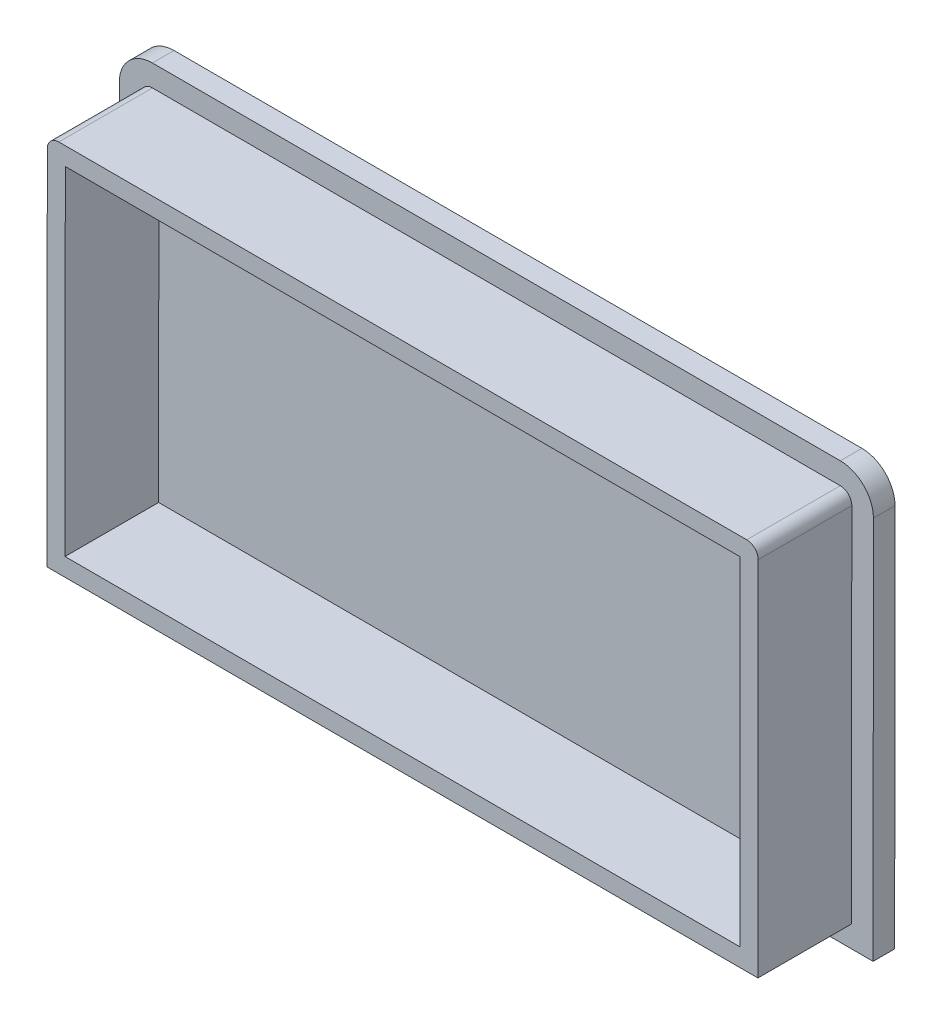
ISO-10303-21;
HEADER;
FILE_DESCRIPTION(('STEP AP214'),'2;1');
FILE_NAME('part.step','',(''),(''),'','','');
FILE_SCHEMA(('AUTOMOTIVE_DESIGN { 1 0 10303 214 1 1 1 1 }'));
ENDSEC;
DATA;
#1=APPLICATION_CONTEXT('core data for automotive mechanical design processes');
#2=APPLICATION_PROTOCOL_DEFINITION('international standard','automotive_design',2000,#1);
#3=PRODUCT_CONTEXT('',#1,'mechanical');
#4=PRODUCT('Part','Part','',(#3));
#5=PRODUCT_RELATED_PRODUCT_CATEGORY('part','',(#4));
#6=PRODUCT_DEFINITION_FORMATION('','',#4);
#7=PRODUCT_DEFINITION_CONTEXT('part definition',#1,'design');
#8=PRODUCT_DEFINITION('design','',#6,#7);
#9=PRODUCT_DEFINITION_SHAPE('','',#8);
#10=(LENGTH_UNIT() NAMED_UNIT(*) SI_UNIT(.MILLI.,.METRE.));
#11=(NAMED_UNIT(*) PLANE_ANGLE_UNIT() SI_UNIT($,.RADIAN.));
#12=(NAMED_UNIT(*) SI_UNIT($,.STERADIAN.) SOLID_ANGLE_UNIT());
#13=UNCERTAINTY_MEASURE_WITH_UNIT(LENGTH_MEASURE(1.E-05),#10,'distance_accuracy_value','');
#14=(GEOMETRIC_REPRESENTATION_CONTEXT(3) GLOBAL_UNCERTAINTY_ASSIGNED_CONTEXT((#13)) GLOBAL_UNIT_ASSIGNED_CONTEXT((#10,
#11,#12)) REPRESENTATION_CONTEXT('',''));
#15=CARTESIAN_POINT('',(0.,0.,0.));
#16=DIRECTION('',(0.,0.,1.));
#17=DIRECTION('',(1.,0.,0.));
#18=AXIS2_PLACEMENT_3D('',#15,#16,#17);
#19=CARTESIAN_POINT('',(-14.0632369728876,53.7477321432282,13.));
#20=DIRECTION('',(0.,0.,1.));
#21=DIRECTION('',(1.,0.,0.));
#22=AXIS2_PLACEMENT_3D('',#19,#20,#21);
#23=PLANE('',#22);
#24=DIRECTION('',(0.000819517229328199,0.999999664195699,0.));
#25=VECTOR('',#24,1.);
#26=CARTESIAN_POINT('',(-12.5044888843404,3.41024879228806,13.));
#27=LINE('',#26,#25);
#28=CARTESIAN_POINT('',(-12.5044888843404,3.41024879228806,13.));
#29=VERTEX_POINT('',#28);
#30=CARTESIAN_POINT('',(-12.4632375101745,53.7464209156613,13.));
#31=VERTEX_POINT('',#30);
#32=EDGE_CURVE('E145',#29,#31,#27,.T.);
#33=ORIENTED_EDGE('',*,*,#32,.T.);
#34=CARTESIAN_POINT('',(-14.0632369728876,53.7477321432282,13.));
#35=DIRECTION('',(0.,0.,1.));
#36=DIRECTION('',(1.,0.,0.));
#37=AXIS2_PLACEMENT_3D('',#34,#35,#36);
#38=CIRCLE('',#37,1.59999999999996);
#39=CARTESIAN_POINT('',(-14.0619257453207,55.3477316059413,13.));
#40=VERTEX_POINT('',#39);
#41=EDGE_CURVE('E156',#31,#40,#38,.T.);
#42=ORIENTED_EDGE('',*,*,#41,.T.);
#43=DIRECTION('',(-0.999999664195699,0.000819517229328083,0.));
#44=VECTOR('',#43,1.);
#45=CARTESIAN_POINT('',(-14.0619257453207,55.3477316059413,13.));
#46=LINE('',#45,#44);
#47=CARTESIAN_POINT('',(-109.606266497076,55.4260318656457,13.));
#48=VERTEX_POINT('',#47);
#49=EDGE_CURVE('E109',#40,#48,#46,.T.);
#50=ORIENTED_EDGE('',*,*,#49,.T.);
#51=CARTESIAN_POINT('',(-109.607577724643,53.8260324029326,13.));
#52=DIRECTION('',(0.,0.,1.));
#53=DIRECTION('',(1.,0.,0.));
#54=AXIS2_PLACEMENT_3D('',#51,#52,#53);
#55=CIRCLE('',#54,1.59999999999998);
#56=CARTESIAN_POINT('',(-111.207577187356,53.8273436304995,13.));
#57=VERTEX_POINT('',#56);
#58=EDGE_CURVE('E102',#48,#57,#55,.T.);
#59=ORIENTED_EDGE('',*,*,#58,.T.);
#60=DIRECTION('',(-0.000819517229326614,-0.999999664195699,0.));
#61=VECTOR('',#60,1.);
#62=CARTESIAN_POINT('',(-111.207577187356,53.8273436304995,13.));
#63=LINE('',#62,#61);
#64=CARTESIAN_POINT('',(-111.248828561522,3.49117150712631,13.));
#65=VERTEX_POINT('',#64);
#66=EDGE_CURVE('E106',#57,#65,#63,.T.);
#67=ORIENTED_EDGE('',*,*,#66,.T.);
#68=DIRECTION('',(0.999999664195699,-0.000819517229327872,0.));
#69=VECTOR('',#68,1.);
#70=CARTESIAN_POINT('',(-111.248828561522,3.49117150712631,13.));
#71=LINE('',#70,#69);
#72=EDGE_CURVE('E58',#65,#29,#71,.T.);
#73=ORIENTED_EDGE('',*,*,#72,.T.);
#74=EDGE_LOOP('',(#33,#42,#50,#59,#67,#73));
#75=FACE_BOUND('',#74,.T.);
#76=DIRECTION('',(0.999999664195699,-0.000819517229327869,0.));
#77=VECTOR('',#76,1.);
#78=CARTESIAN_POINT('',(-108.74678060796,5.98912187454224,13.));
#79=LINE('',#78,#77);
#80=CARTESIAN_POINT('',(-108.74678060796,5.98912187454224,13.));
#81=VERTEX_POINT('',#80);
#82=CARTESIAN_POINT('',(-15.0024392517564,5.91229674585063,13.));
#83=VERTEX_POINT('',#82);
#84=EDGE_CURVE('E185',#81,#83,#79,.T.);
#85=ORIENTED_EDGE('',*,*,#84,.F.);
#86=DIRECTION('',(-0.000819517229326577,-0.999999664195699,0.));
#87=VECTOR('',#86,1.);
#88=CARTESIAN_POINT('',(-108.708315592374,52.9252951396501,13.));
#89=LINE('',#88,#87);
#90=CARTESIAN_POINT('',(-108.708315592374,52.9252951396501,13.));
#91=VERTEX_POINT('',#90);
#92=EDGE_CURVE('E178',#91,#81,#89,.T.);
#93=ORIENTED_EDGE('',*,*,#92,.F.);
#94=DIRECTION('',(-0.999999664195699,0.000819517229328146,0.));
#95=VECTOR('',#94,1.);
#96=CARTESIAN_POINT('',(-14.9639742361702,52.8484700109585,13.));
#97=LINE('',#96,#95);
#98=CARTESIAN_POINT('',(-14.9639742361702,52.8484700109585,13.));
#99=VERTEX_POINT('',#98);
#100=EDGE_CURVE('E80',#99,#91,#97,.T.);
#101=ORIENTED_EDGE('',*,*,#100,.F.);
#102=DIRECTION('',(0.000819517229328204,0.999999664195699,0.));
#103=VECTOR('',#102,1.);
#104=CARTESIAN_POINT('',(-15.0024392517564,5.91229674585063,13.));
#105=LINE('',#104,#103);
#106=EDGE_CURVE('E196',#83,#99,#105,.T.);
#107=ORIENTED_EDGE('',*,*,#106,.F.);
#108=EDGE_LOOP('',(#85,#93,#101,#107));
#109=FACE_BOUND('',#108,.T.);
#110=ADVANCED_FACE('F34',(#75,#109),#23,.T.);
#111=CARTESIAN_POINT('',(-12.5044888843404,3.41024879228806,13.));
#112=DIRECTION('',(-0.999999664195699,0.000819517229328199,0.));
#113=DIRECTION('',(-0.000819517229328199,-0.999999664195699,0.));
#114=AXIS2_PLACEMENT_3D('',#111,#112,#113);
#115=PLANE('',#114);
#116=DIRECTION('',(0.000819517229328199,0.999999664195699,0.));
#117=VECTOR('',#116,1.);
#118=CARTESIAN_POINT('',(-12.5044888843404,3.41024879228806,0.));
#119=LINE('',#118,#117);
#120=CARTESIAN_POINT('',(-12.5044888843404,3.41024879228806,0.));
#121=VERTEX_POINT('',#120);
#122=CARTESIAN_POINT('',(-12.4632375101745,53.7464209156613,0.));
#123=VERTEX_POINT('',#122);
#124=EDGE_CURVE('E132',#121,#123,#119,.T.);
#125=ORIENTED_EDGE('',*,*,#124,.T.);
#126=DIRECTION('',(0.,0.,-1.));
#127=VECTOR('',#126,1.);
#128=CARTESIAN_POINT('',(-12.4632375101745,53.7464209156613,13.));
#129=LINE('',#128,#127);
#130=EDGE_CURVE('E11',#31,#123,#129,.T.);
#131=ORIENTED_EDGE('',*,*,#130,.F.);
#132=ORIENTED_EDGE('',*,*,#32,.F.);
#133=DIRECTION('',(0.,0.,-1.));
#134=VECTOR('',#133,1.);
#135=CARTESIAN_POINT('',(-12.5044888843404,3.41024879228806,13.));
#136=LINE('',#135,#134);
#137=EDGE_CURVE('E128',#29,#121,#136,.T.);
#138=ORIENTED_EDGE('',*,*,#137,.T.);
#139=EDGE_LOOP('',(#125,#131,#132,#138));
#140=FACE_BOUND('',#139,.T.);
#141=ADVANCED_FACE('F36',(#140),#115,.F.);
#142=CARTESIAN_POINT('',(-14.0632369728876,53.7477321432282,13.));
#143=DIRECTION('',(0.,0.,-1.));
#144=DIRECTION('',(-1.,0.,0.));
#145=AXIS2_PLACEMENT_3D('',#142,#143,#144);
#146=CYLINDRICAL_SURFACE('',#145,1.59999999999996);
#147=CARTESIAN_POINT('',(-14.0632369728876,53.7477321432282,0.));
#148=DIRECTION('',(0.,0.,1.));
#149=DIRECTION('',(1.,0.,0.));
#150=AXIS2_PLACEMENT_3D('',#147,#148,#149);
#151=CIRCLE('',#150,1.59999999999996);
#152=CARTESIAN_POINT('',(-14.0619257453207,55.3477316059413,0.));
#153=VERTEX_POINT('',#152);
#154=EDGE_CURVE('E135',#123,#153,#151,.T.);
#155=ORIENTED_EDGE('',*,*,#154,.T.);
#156=DIRECTION('',(0.,0.,-1.));
#157=VECTOR('',#156,1.);
#158=CARTESIAN_POINT('',(-14.0619257453207,55.3477316059413,13.));
#159=LINE('',#158,#157);
#160=EDGE_CURVE('E42',#40,#153,#159,.T.);
#161=ORIENTED_EDGE('',*,*,#160,.F.);
#162=ORIENTED_EDGE('',*,*,#41,.F.);
#163=ORIENTED_EDGE('',*,*,#130,.T.);
#164=EDGE_LOOP('',(#155,#161,#162,#163));
#165=FACE_BOUND('',#164,.T.);
#166=ADVANCED_FACE('F155',(#165),#146,.T.);
#167=CARTESIAN_POINT('',(-14.0619257453207,55.3477316059413,13.));
#168=DIRECTION('',(-0.000819517229328083,-0.999999664195699,0.));
#169=DIRECTION('',(0.999999664195699,-0.000819517229328083,0.));
#170=AXIS2_PLACEMENT_3D('',#167,#168,#169);
#171=PLANE('',#170);
#172=DIRECTION('',(-0.999999664195699,0.000819517229328083,0.));
#173=VECTOR('',#172,1.);
#174=CARTESIAN_POINT('',(-14.0619257453207,55.3477316059413,0.));
#175=LINE('',#174,#173);
#176=CARTESIAN_POINT('',(-109.606266497076,55.4260318656457,0.));
#177=VERTEX_POINT('',#176);
#178=EDGE_CURVE('E71',#153,#177,#175,.T.);
#179=ORIENTED_EDGE('',*,*,#178,.T.);
#180=DIRECTION('',(0.,0.,-1.));
#181=VECTOR('',#180,1.);
#182=CARTESIAN_POINT('',(-109.606266497076,55.4260318656457,13.));
#183=LINE('',#182,#181);
#184=EDGE_CURVE('E122',#48,#177,#183,.T.);
#185=ORIENTED_EDGE('',*,*,#184,.F.);
#186=ORIENTED_EDGE('',*,*,#49,.F.);
#187=ORIENTED_EDGE('',*,*,#160,.T.);
#188=EDGE_LOOP('',(#179,#185,#186,#187));
#189=FACE_BOUND('',#188,.T.);
#190=ADVANCED_FACE('F152',(#189),#171,.F.);
#191=CARTESIAN_POINT('',(-109.607577724643,53.8260324029326,13.));
#192=DIRECTION('',(0.,0.,-1.));
#193=DIRECTION('',(-1.,0.,0.));
#194=AXIS2_PLACEMENT_3D('',#191,#192,#193);
#195=CYLINDRICAL_SURFACE('',#194,1.59999999999998);
#196=CARTESIAN_POINT('',(-109.607577724643,53.8260324029326,0.));
#197=DIRECTION('',(0.,0.,1.));
#198=DIRECTION('',(1.,0.,0.));
#199=AXIS2_PLACEMENT_3D('',#196,#197,#198);
#200=CIRCLE('',#199,1.59999999999998);
#201=CARTESIAN_POINT('',(-111.207577187356,53.8273436304995,0.));
#202=VERTEX_POINT('',#201);
#203=EDGE_CURVE('E119',#177,#202,#200,.T.);
#204=ORIENTED_EDGE('',*,*,#203,.T.);
#205=DIRECTION('',(0.,0.,-1.));
#206=VECTOR('',#205,1.);
#207=CARTESIAN_POINT('',(-111.207577187356,53.8273436304995,13.));
#208=LINE('',#207,#206);
#209=EDGE_CURVE('E116',#57,#202,#208,.T.);
#210=ORIENTED_EDGE('',*,*,#209,.F.);
#211=ORIENTED_EDGE('',*,*,#58,.F.);
#212=ORIENTED_EDGE('',*,*,#184,.T.);
#213=EDGE_LOOP('',(#204,#210,#211,#212));
#214=FACE_BOUND('',#213,.T.);
#215=ADVANCED_FACE('F117',(#214),#195,.T.);
#216=CARTESIAN_POINT('',(-111.207577187356,53.8273436304995,13.));
#217=DIRECTION('',(0.999999664195699,-0.000819517229326614,0.));
#218=DIRECTION('',(0.000819517229326614,0.999999664195699,0.));
#219=AXIS2_PLACEMENT_3D('',#216,#217,#218);
#220=PLANE('',#219);
#221=DIRECTION('',(-0.000819517229326614,-0.999999664195699,0.));
#222=VECTOR('',#221,1.);
#223=CARTESIAN_POINT('',(-111.207577187356,53.8273436304995,0.));
#224=LINE('',#223,#222);
#225=CARTESIAN_POINT('',(-111.248828561522,3.49117150712631,0.));
#226=VERTEX_POINT('',#225);
#227=EDGE_CURVE('E140',#202,#226,#224,.T.);
#228=ORIENTED_EDGE('',*,*,#227,.T.);
#229=DIRECTION('',(0.,0.,-1.));
#230=VECTOR('',#229,1.);
#231=CARTESIAN_POINT('',(-111.248828561522,3.49117150712631,13.));
#232=LINE('',#231,#230);
#233=EDGE_CURVE('E123',#65,#226,#232,.T.);
#234=ORIENTED_EDGE('',*,*,#233,.F.);
#235=ORIENTED_EDGE('',*,*,#66,.F.);
#236=ORIENTED_EDGE('',*,*,#209,.T.);
#237=EDGE_LOOP('',(#228,#234,#235,#236));
#238=FACE_BOUND('',#237,.T.);
#239=ADVANCED_FACE('F125',(#238),#220,.F.);
#240=CARTESIAN_POINT('',(-111.248828561522,3.49117150712631,13.));
#241=DIRECTION('',(0.000819517229327872,0.999999664195699,0.));
#242=DIRECTION('',(-0.999999664195699,0.000819517229327872,0.));
#243=AXIS2_PLACEMENT_3D('',#240,#241,#242);
#244=PLANE('',#243);
#245=DIRECTION('',(0.999999664195699,-0.000819517229327872,0.));
#246=VECTOR('',#245,1.);
#247=CARTESIAN_POINT('',(-111.248828561522,3.49117150712631,0.));
#248=LINE('',#247,#246);
#249=EDGE_CURVE('E142',#226,#121,#248,.T.);
#250=ORIENTED_EDGE('',*,*,#249,.T.);
#251=ORIENTED_EDGE('',*,*,#137,.F.);
#252=ORIENTED_EDGE('',*,*,#72,.F.);
#253=ORIENTED_EDGE('',*,*,#233,.T.);
#254=EDGE_LOOP('',(#250,#251,#252,#253));
#255=FACE_BOUND('',#254,.T.);
#256=ADVANCED_FACE('F218',(#255),#244,.F.);
#257=CARTESIAN_POINT('',(-108.708315592374,52.9252951396501,13.));
#258=DIRECTION('',(0.999999664195699,-0.000819517229326577,0.));
#259=DIRECTION('',(0.000819517229326577,0.999999664195699,0.));
#260=AXIS2_PLACEMENT_3D('',#257,#258,#259);
#261=PLANE('',#260);
#262=DIRECTION('',(-0.000819517229326577,-0.999999664195699,0.));
#263=VECTOR('',#262,1.);
#264=CARTESIAN_POINT('',(-108.708315592374,52.9252951396501,0.));
#265=LINE('',#264,#263);
#266=CARTESIAN_POINT('',(-108.708315592374,52.9252951396501,0.));
#267=VERTEX_POINT('',#266);
#268=CARTESIAN_POINT('',(-108.74678060796,5.98912187454224,0.));
#269=VERTEX_POINT('',#268);
#270=EDGE_CURVE('E202',#267,#269,#265,.T.);
#271=ORIENTED_EDGE('',*,*,#270,.F.);
#272=DIRECTION('',(0.,0.,-1.));
#273=VECTOR('',#272,1.);
#274=CARTESIAN_POINT('',(-108.708315592374,52.9252951396501,13.));
#275=LINE('',#274,#273);
#276=EDGE_CURVE('E183',#91,#267,#275,.T.);
#277=ORIENTED_EDGE('',*,*,#276,.F.);
#278=ORIENTED_EDGE('',*,*,#92,.T.);
#279=DIRECTION('',(0.,0.,-1.));
#280=VECTOR('',#279,1.);
#281=CARTESIAN_POINT('',(-108.74678060796,5.98912187454224,13.));
#282=LINE('',#281,#280);
#283=EDGE_CURVE('E136',#81,#269,#282,.T.);
#284=ORIENTED_EDGE('',*,*,#283,.T.);
#285=EDGE_LOOP('',(#271,#277,#278,#284));
#286=FACE_BOUND('',#285,.T.);
#287=ADVANCED_FACE('F181',(#286),#261,.T.);
#288=CARTESIAN_POINT('',(-108.74678060796,5.98912187454224,13.));
#289=DIRECTION('',(0.000819517229327869,0.999999664195699,0.));
#290=DIRECTION('',(-0.999999664195699,0.000819517229327869,0.));
#291=AXIS2_PLACEMENT_3D('',#288,#289,#290);
#292=PLANE('',#291);
#293=DIRECTION('',(0.999999664195699,-0.000819517229327869,0.));
#294=VECTOR('',#293,1.);
#295=CARTESIAN_POINT('',(-108.74678060796,5.98912187454224,0.));
#296=LINE('',#295,#294);
#297=CARTESIAN_POINT('',(-15.0024392517564,5.91229674585063,0.));
#298=VERTEX_POINT('',#297);
#299=EDGE_CURVE('E192',#269,#298,#296,.T.);
#300=ORIENTED_EDGE('',*,*,#299,.F.);
#301=ORIENTED_EDGE('',*,*,#283,.F.);
#302=ORIENTED_EDGE('',*,*,#84,.T.);
#303=DIRECTION('',(0.,0.,-1.));
#304=VECTOR('',#303,1.);
#305=CARTESIAN_POINT('',(-15.0024392517564,5.91229674585063,13.));
#306=LINE('',#305,#304);
#307=EDGE_CURVE('E193',#83,#298,#306,.T.);
#308=ORIENTED_EDGE('',*,*,#307,.T.);
#309=EDGE_LOOP('',(#300,#301,#302,#308));
#310=FACE_BOUND('',#309,.T.);
#311=ADVANCED_FACE('F189',(#310),#292,.T.);
#312=CARTESIAN_POINT('',(-15.0024392517564,5.91229674585063,13.));
#313=DIRECTION('',(-0.999999664195699,0.000819517229328204,0.));
#314=DIRECTION('',(-0.000819517229328204,-0.999999664195699,0.));
#315=AXIS2_PLACEMENT_3D('',#312,#313,#314);
#316=PLANE('',#315);
#317=DIRECTION('',(0.000819517229328204,0.999999664195699,0.));
#318=VECTOR('',#317,1.);
#319=CARTESIAN_POINT('',(-15.0024392517564,5.91229674585063,0.));
#320=LINE('',#319,#318);
#321=CARTESIAN_POINT('',(-14.9639742361702,52.8484700109585,0.));
#322=VERTEX_POINT('',#321);
#323=EDGE_CURVE('E206',#298,#322,#320,.T.);
#324=ORIENTED_EDGE('',*,*,#323,.F.);
#325=ORIENTED_EDGE('',*,*,#307,.F.);
#326=ORIENTED_EDGE('',*,*,#106,.T.);
#327=DIRECTION('',(0.,0.,-1.));
#328=VECTOR('',#327,1.);
#329=CARTESIAN_POINT('',(-14.9639742361702,52.8484700109585,13.));
#330=LINE('',#329,#328);
#331=EDGE_CURVE('E49',#99,#322,#330,.T.);
#332=ORIENTED_EDGE('',*,*,#331,.T.);
#333=EDGE_LOOP('',(#324,#325,#326,#332));
#334=FACE_BOUND('',#333,.T.);
#335=ADVANCED_FACE('F235',(#334),#316,.T.);
#336=CARTESIAN_POINT('',(-14.9639742361702,52.8484700109585,13.));
#337=DIRECTION('',(-0.000819517229328146,-0.999999664195699,0.));
#338=DIRECTION('',(0.999999664195699,-0.000819517229328146,0.));
#339=AXIS2_PLACEMENT_3D('',#336,#337,#338);
#340=PLANE('',#339);
#341=DIRECTION('',(-0.999999664195699,0.000819517229328146,0.));
#342=VECTOR('',#341,1.);
#343=CARTESIAN_POINT('',(-14.9639742361702,52.8484700109585,0.));
#344=LINE('',#343,#342);
#345=EDGE_CURVE('E186',#322,#267,#344,.T.);
#346=ORIENTED_EDGE('',*,*,#345,.F.);
#347=ORIENTED_EDGE('',*,*,#331,.F.);
#348=ORIENTED_EDGE('',*,*,#100,.T.);
#349=ORIENTED_EDGE('',*,*,#276,.T.);
#350=EDGE_LOOP('',(#346,#347,#348,#349));
#351=FACE_BOUND('',#350,.T.);
#352=ADVANCED_FACE('F238',(#351),#340,.T.);
#353=CARTESIAN_POINT('',(-14.0632369728876,53.7477321432282,0.));
#354=DIRECTION('',(0.,0.,-1.));
#355=DIRECTION('',(-1.,0.,0.));
#356=AXIS2_PLACEMENT_3D('',#353,#354,#355);
#357=PLANE('',#356);
#358=ORIENTED_EDGE('',*,*,#345,.T.);
#359=ORIENTED_EDGE('',*,*,#270,.T.);
#360=ORIENTED_EDGE('',*,*,#299,.T.);
#361=ORIENTED_EDGE('',*,*,#323,.T.);
#362=EDGE_LOOP('',(#358,#359,#360,#361));
#363=FACE_BOUND('',#362,.T.);
#364=ADVANCED_FACE('F242',(#363),#357,.F.);
#365=CARTESIAN_POINT('',(-14.0632369728876,53.7477321432282,-3.));
#366=DIRECTION('',(0.,0.,1.));
#367=DIRECTION('',(1.,0.,0.));
#368=AXIS2_PLACEMENT_3D('',#365,#366,#367);
#369=CYLINDRICAL_SURFACE('',#368,4.59999999999996);
#370=CARTESIAN_POINT('',(-14.0632369728876,53.7477321432282,0.));
#371=DIRECTION('',(0.,0.,-1.));
#372=DIRECTION('',(-1.,0.,0.));
#373=AXIS2_PLACEMENT_3D('',#370,#371,#372);
#374=CIRCLE('',#373,4.59999999999996);
#375=CARTESIAN_POINT('',(-14.0594671936327,58.3477305985284,0.));
#376=VERTEX_POINT('',#375);
#377=CARTESIAN_POINT('',(-9.46323851758743,53.7439623639733,0.));
#378=VERTEX_POINT('',#377);
#379=EDGE_CURVE('E299',#376,#378,#374,.T.);
#380=ORIENTED_EDGE('',*,*,#379,.T.);
#381=DIRECTION('',(0.,0.,1.));
#382=VECTOR('',#381,1.);
#383=CARTESIAN_POINT('',(-9.46323851758743,53.7439623639733,-3.));
#384=LINE('',#383,#382);
#385=CARTESIAN_POINT('',(-9.46323851758743,53.7439623639733,-3.));
#386=VERTEX_POINT('',#385);
#387=EDGE_CURVE('E204',#386,#378,#384,.T.);
#388=ORIENTED_EDGE('',*,*,#387,.F.);
#389=CARTESIAN_POINT('',(-14.0632369728876,53.7477321432282,-3.));
#390=DIRECTION('',(0.,0.,-1.));
#391=DIRECTION('',(-1.,0.,0.));
#392=AXIS2_PLACEMENT_3D('',#389,#390,#391);
#393=CIRCLE('',#392,4.59999999999996);
#394=CARTESIAN_POINT('',(-14.0594671936327,58.3477305985284,-3.));
#395=VERTEX_POINT('',#394);
#396=EDGE_CURVE('E279',#395,#386,#393,.T.);
#397=ORIENTED_EDGE('',*,*,#396,.F.);
#398=DIRECTION('',(0.,0.,1.));
#399=VECTOR('',#398,1.);
#400=CARTESIAN_POINT('',(-14.0594671936327,58.3477305985284,-3.));
#401=LINE('',#400,#399);
#402=EDGE_CURVE('E314',#395,#376,#401,.T.);
#403=ORIENTED_EDGE('',*,*,#402,.T.);
#404=EDGE_LOOP('',(#380,#388,#397,#403));
#405=FACE_BOUND('',#404,.T.);
#406=ADVANCED_FACE('F243',(#405),#369,.T.);
#407=CARTESIAN_POINT('',(-9.46323851758743,53.7439623639733,-3.));
#408=DIRECTION('',(-0.999999664195699,0.000819517229328249,0.));
#409=DIRECTION('',(-0.00081951722932825,-0.999999664195699,0.));
#410=AXIS2_PLACEMENT_3D('',#407,#408,#409);
#411=PLANE('',#410);
#412=DIRECTION('',(-0.000819517229328249,-0.999999664195699,0.));
#413=VECTOR('',#412,1.);
#414=CARTESIAN_POINT('',(-9.46323851758743,53.7439623639733,0.));
#415=LINE('',#414,#413);
#416=CARTESIAN_POINT('',(-9.50694844344134,0.407791248012984,0.));
#417=VERTEX_POINT('',#416);
#418=EDGE_CURVE('E327',#378,#417,#415,.T.);
#419=ORIENTED_EDGE('',*,*,#418,.T.);
#420=DIRECTION('',(0.,0.,1.));
#421=VECTOR('',#420,1.);
#422=CARTESIAN_POINT('',(-9.50694844344134,0.407791248012984,-3.));
#423=LINE('',#422,#421);
#424=CARTESIAN_POINT('',(-9.50694844344134,0.407791248012984,-3.));
#425=VERTEX_POINT('',#424);
#426=EDGE_CURVE('E301',#425,#417,#423,.T.);
#427=ORIENTED_EDGE('',*,*,#426,.F.);
#428=DIRECTION('',(-0.000819517229328249,-0.999999664195699,0.));
#429=VECTOR('',#428,1.);
#430=CARTESIAN_POINT('',(-9.46323851758743,53.7439623639733,-3.));
#431=LINE('',#430,#429);
#432=EDGE_CURVE('E284',#386,#425,#431,.T.);
#433=ORIENTED_EDGE('',*,*,#432,.F.);
#434=ORIENTED_EDGE('',*,*,#387,.T.);
#435=EDGE_LOOP('',(#419,#427,#433,#434));
#436=FACE_BOUND('',#435,.T.);
#437=ADVANCED_FACE('F246',(#436),#411,.F.);
#438=CARTESIAN_POINT('',(-9.50694844344134,0.407791248012984,-3.));
#439=DIRECTION('',(0.000819517229327872,0.999999664195699,0.));
#440=DIRECTION('',(-0.999999664195699,0.000819517229327872,0.));
#441=AXIS2_PLACEMENT_3D('',#438,#439,#440);
#442=PLANE('',#441);
#443=DIRECTION('',(-0.999999664195699,0.000819517229327872,0.));
#444=VECTOR('',#443,1.);
#445=CARTESIAN_POINT('',(-9.50694844344134,0.407791248012984,0.));
#446=LINE('',#445,#444);
#447=CARTESIAN_POINT('',(-114.251286105797,0.493631066227201,0.));
#448=VERTEX_POINT('',#447);
#449=EDGE_CURVE('E324',#417,#448,#446,.T.);
#450=ORIENTED_EDGE('',*,*,#449,.T.);
#451=DIRECTION('',(0.,0.,1.));
#452=VECTOR('',#451,1.);
#453=CARTESIAN_POINT('',(-114.251286105797,0.493631066227201,-3.));
#454=LINE('',#453,#452);
#455=CARTESIAN_POINT('',(-114.251286105797,0.493631066227201,-3.));
#456=VERTEX_POINT('',#455);
#457=EDGE_CURVE('E303',#456,#448,#454,.T.);
#458=ORIENTED_EDGE('',*,*,#457,.F.);
#459=DIRECTION('',(-0.999999664195699,0.000819517229327872,0.));
#460=VECTOR('',#459,1.);
#461=CARTESIAN_POINT('',(-9.50694844344134,0.407791248012984,-3.));
#462=LINE('',#461,#460);
#463=EDGE_CURVE('E336',#425,#456,#462,.T.);
#464=ORIENTED_EDGE('',*,*,#463,.F.);
#465=ORIENTED_EDGE('',*,*,#426,.T.);
#466=EDGE_LOOP('',(#450,#458,#464,#465));
#467=FACE_BOUND('',#466,.T.);
#468=ADVANCED_FACE('F250',(#467),#442,.F.);
#469=CARTESIAN_POINT('',(-114.251286105797,0.493631066227201,-3.));
#470=DIRECTION('',(0.999999664195699,-0.000819517229326689,0.));
#471=DIRECTION('',(0.000819517229326689,0.999999664195699,0.));
#472=AXIS2_PLACEMENT_3D('',#469,#470,#471);
#473=PLANE('',#472);
#474=DIRECTION('',(0.000819517229326688,0.999999664195699,0.));
#475=VECTOR('',#474,1.);
#476=CARTESIAN_POINT('',(-114.251286105797,0.493631066227201,0.));
#477=LINE('',#476,#475);
#478=CARTESIAN_POINT('',(-114.207576179944,53.8298021821875,0.));
#479=VERTEX_POINT('',#478);
#480=EDGE_CURVE('E321',#448,#479,#477,.T.);
#481=ORIENTED_EDGE('',*,*,#480,.T.);
#482=DIRECTION('',(0.,0.,1.));
#483=VECTOR('',#482,1.);
#484=CARTESIAN_POINT('',(-114.207576179944,53.8298021821875,-3.));
#485=LINE('',#484,#483);
#486=CARTESIAN_POINT('',(-114.207576179944,53.8298021821875,-3.));
#487=VERTEX_POINT('',#486);
#488=EDGE_CURVE('E308',#487,#479,#485,.T.);
#489=ORIENTED_EDGE('',*,*,#488,.F.);
#490=DIRECTION('',(0.000819517229326688,0.999999664195699,0.));
#491=VECTOR('',#490,1.);
#492=CARTESIAN_POINT('',(-114.251286105797,0.493631066227201,-3.));
#493=LINE('',#492,#491);
#494=EDGE_CURVE('E333',#456,#487,#493,.T.);
#495=ORIENTED_EDGE('',*,*,#494,.F.);
#496=ORIENTED_EDGE('',*,*,#457,.T.);
#497=EDGE_LOOP('',(#481,#489,#495,#496));
#498=FACE_BOUND('',#497,.T.);
#499=ADVANCED_FACE('F254',(#498),#473,.F.);
#500=CARTESIAN_POINT('',(-109.607577724643,53.8260324029326,-3.));
#501=DIRECTION('',(0.,0.,1.));
#502=DIRECTION('',(1.,0.,0.));
#503=AXIS2_PLACEMENT_3D('',#500,#501,#502);
#504=CYLINDRICAL_SURFACE('',#503,4.59999999999996);
#505=CARTESIAN_POINT('',(-109.607577724643,53.8260324029326,0.));
#506=DIRECTION('',(0.,0.,-1.));
#507=DIRECTION('',(-1.,0.,0.));
#508=AXIS2_PLACEMENT_3D('',#505,#506,#507);
#509=CIRCLE('',#508,4.59999999999996);
#510=CARTESIAN_POINT('',(-109.603807945388,58.4260308582328,0.));
#511=VERTEX_POINT('',#510);
#512=EDGE_CURVE('E318',#479,#511,#509,.T.);
#513=ORIENTED_EDGE('',*,*,#512,.T.);
#514=DIRECTION('',(0.,0.,1.));
#515=VECTOR('',#514,1.);
#516=CARTESIAN_POINT('',(-109.603807945388,58.4260308582328,-3.));
#517=LINE('',#516,#515);
#518=CARTESIAN_POINT('',(-109.603807945388,58.4260308582328,-3.));
#519=VERTEX_POINT('',#518);
#520=EDGE_CURVE('E311',#519,#511,#517,.T.);
#521=ORIENTED_EDGE('',*,*,#520,.F.);
#522=CARTESIAN_POINT('',(-109.607577724643,53.8260324029326,-3.));
#523=DIRECTION('',(0.,0.,-1.));
#524=DIRECTION('',(-1.,0.,0.));
#525=AXIS2_PLACEMENT_3D('',#522,#523,#524);
#526=CIRCLE('',#525,4.59999999999996);
#527=EDGE_CURVE('E331',#487,#519,#526,.T.);
#528=ORIENTED_EDGE('',*,*,#527,.F.);
#529=ORIENTED_EDGE('',*,*,#488,.T.);
#530=EDGE_LOOP('',(#513,#521,#528,#529));
#531=FACE_BOUND('',#530,.T.);
#532=ADVANCED_FACE('F258',(#531),#504,.T.);
#533=CARTESIAN_POINT('',(-109.603807945388,58.4260308582328,-3.));
#534=DIRECTION('',(-0.000819517229327574,-0.999999664195699,0.));
#535=DIRECTION('',(0.999999664195699,-0.000819517229327574,0.));
#536=AXIS2_PLACEMENT_3D('',#533,#534,#535);
#537=PLANE('',#536);
#538=DIRECTION('',(0.999999664195699,-0.000819517229327574,0.));
#539=VECTOR('',#538,1.);
#540=CARTESIAN_POINT('',(-109.603807945388,58.4260308582328,0.));
#541=LINE('',#540,#539);
#542=EDGE_CURVE('E293',#511,#376,#541,.T.);
#543=ORIENTED_EDGE('',*,*,#542,.T.);
#544=ORIENTED_EDGE('',*,*,#402,.F.);
#545=DIRECTION('',(0.999999664195699,-0.000819517229327574,0.));
#546=VECTOR('',#545,1.);
#547=CARTESIAN_POINT('',(-109.603807945388,58.4260308582328,-3.));
#548=LINE('',#547,#546);
#549=EDGE_CURVE('E288',#519,#395,#548,.T.);
#550=ORIENTED_EDGE('',*,*,#549,.F.);
#551=ORIENTED_EDGE('',*,*,#520,.T.);
#552=EDGE_LOOP('',(#543,#544,#550,#551));
#553=FACE_BOUND('',#552,.T.);
#554=ADVANCED_FACE('F262',(#553),#537,.F.);
#555=CARTESIAN_POINT('',(-14.0632369728876,53.7477321432282,-3.));
#556=DIRECTION('',(0.,0.,-1.));
#557=DIRECTION('',(-1.,0.,0.));
#558=AXIS2_PLACEMENT_3D('',#555,#556,#557);
#559=PLANE('',#558);
#560=ORIENTED_EDGE('',*,*,#396,.T.);
#561=ORIENTED_EDGE('',*,*,#432,.T.);
#562=ORIENTED_EDGE('',*,*,#463,.T.);
#563=ORIENTED_EDGE('',*,*,#494,.T.);
#564=ORIENTED_EDGE('',*,*,#527,.T.);
#565=ORIENTED_EDGE('',*,*,#549,.T.);
#566=EDGE_LOOP('',(#560,#561,#562,#563,#564,#565));
#567=FACE_BOUND('',#566,.T.);
#568=ADVANCED_FACE('F266',(#567),#559,.T.);
#569=ORIENTED_EDGE('',*,*,#124,.F.);
#570=ORIENTED_EDGE('',*,*,#249,.F.);
#571=ORIENTED_EDGE('',*,*,#227,.F.);
#572=ORIENTED_EDGE('',*,*,#203,.F.);
#573=ORIENTED_EDGE('',*,*,#178,.F.);
#574=ORIENTED_EDGE('',*,*,#154,.F.);
#575=EDGE_LOOP('',(#569,#570,#571,#572,#573,#574));
#576=FACE_BOUND('',#575,.T.);
#577=ORIENTED_EDGE('',*,*,#379,.F.);
#578=ORIENTED_EDGE('',*,*,#542,.F.);
#579=ORIENTED_EDGE('',*,*,#512,.F.);
#580=ORIENTED_EDGE('',*,*,#480,.F.);
#581=ORIENTED_EDGE('',*,*,#449,.F.);
#582=ORIENTED_EDGE('',*,*,#418,.F.);
#583=EDGE_LOOP('',(#577,#578,#579,#580,#581,#582));
#584=FACE_BOUND('',#583,.T.);
#585=ADVANCED_FACE('F160',(#576,#584),#357,.F.);
#586=CLOSED_SHELL('',(#110,#141,#166,#190,#215,#239,#256,#287,#311,#335,#352,#364,#406,#437,
#468,#499,#532,#554,#568,#585));
#587=MANIFOLD_SOLID_BREP('B2',#586);
#588=ADVANCED_BREP_SHAPE_REPRESENTATION('',(#18,#587),#14);
#589=SHAPE_DEFINITION_REPRESENTATION(#9,#588);
ENDSEC;
END-ISO-10303-21;
